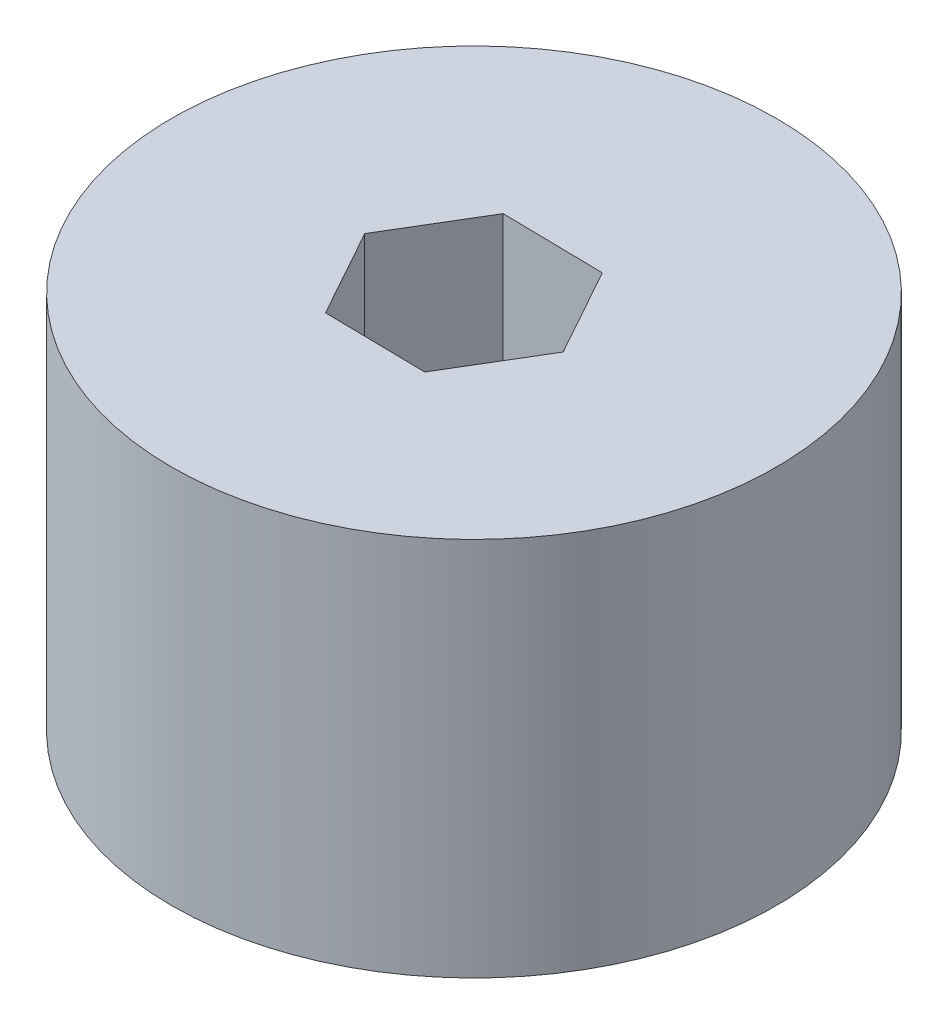
ISO-10303-21;
HEADER;
FILE_DESCRIPTION(('STEP AP214'),'2;1');
FILE_NAME('part.step','',(''),(''),'','','');
FILE_SCHEMA(('AUTOMOTIVE_DESIGN { 1 0 10303 214 1 1 1 1 }'));
ENDSEC;
DATA;
#1=APPLICATION_CONTEXT('core data for automotive mechanical design processes');
#2=APPLICATION_PROTOCOL_DEFINITION('international standard','automotive_design',2000,#1);
#3=PRODUCT_CONTEXT('',#1,'mechanical');
#4=PRODUCT('Part','Part','',(#3));
#5=PRODUCT_RELATED_PRODUCT_CATEGORY('part','',(#4));
#6=PRODUCT_DEFINITION_FORMATION('','',#4);
#7=PRODUCT_DEFINITION_CONTEXT('part definition',#1,'design');
#8=PRODUCT_DEFINITION('design','',#6,#7);
#9=PRODUCT_DEFINITION_SHAPE('','',#8);
#10=(LENGTH_UNIT() NAMED_UNIT(*) SI_UNIT(.MILLI.,.METRE.));
#11=(NAMED_UNIT(*) PLANE_ANGLE_UNIT() SI_UNIT($,.RADIAN.));
#12=(NAMED_UNIT(*) SI_UNIT($,.STERADIAN.) SOLID_ANGLE_UNIT());
#13=UNCERTAINTY_MEASURE_WITH_UNIT(LENGTH_MEASURE(1.E-05),#10,'distance_accuracy_value','');
#14=(GEOMETRIC_REPRESENTATION_CONTEXT(3) GLOBAL_UNCERTAINTY_ASSIGNED_CONTEXT((#13)) GLOBAL_UNIT_ASSIGNED_CONTEXT((#10,
#11,#12)) REPRESENTATION_CONTEXT('',''));
#15=CARTESIAN_POINT('',(0.,0.,0.));
#16=DIRECTION('',(0.,0.,1.));
#17=DIRECTION('',(1.,0.,0.));
#18=AXIS2_PLACEMENT_3D('',#15,#16,#17);
#19=CARTESIAN_POINT('',(0.,25.4,0.));
#20=DIRECTION('',(0.,1.,0.));
#21=DIRECTION('',(0.,0.,1.));
#22=AXIS2_PLACEMENT_3D('',#19,#20,#21);
#23=PLANE('',#22);
#24=CARTESIAN_POINT('',(0.,25.4,0.));
#25=DIRECTION('',(0.,1.,0.));
#26=DIRECTION('',(0.,0.,1.));
#27=AXIS2_PLACEMENT_3D('',#24,#25,#26);
#28=CIRCLE('',#27,20.209977283272);
#29=CARTESIAN_POINT('',(0.,25.4,20.209977283272));
#30=VERTEX_POINT('',#29);
#31=EDGE_CURVE('E11',#30,#30,#28,.T.);
#32=ORIENTED_EDGE('',*,*,#31,.T.);
#33=EDGE_LOOP('',(#32));
#34=FACE_BOUND('',#33,.T.);
#35=DIRECTION('',(0.514220942434934,0.,-0.857657753629808));
#36=VECTOR('',#35,1.);
#37=CARTESIAN_POINT('',(2.94549259193232,25.4,6.23963990172511));
#38=LINE('',#37,#36);
#39=CARTESIAN_POINT('',(2.94549259193232,25.4,6.23963990172511));
#40=VERTEX_POINT('',#39);
#41=CARTESIAN_POINT('',(6.41455048262457,25.4,0.453674857877559));
#42=VERTEX_POINT('',#41);
#43=EDGE_CURVE('E102',#40,#42,#38,.T.);
#44=ORIENTED_EDGE('',*,*,#43,.F.);
#45=DIRECTION('',(0.999863873613576,0.,0.0164995224917249));
#46=VECTOR('',#45,1.);
#47=CARTESIAN_POINT('',(-3.79982906679453,25.4,6.12833016311054));
#48=LINE('',#47,#46);
#49=CARTESIAN_POINT('',(-3.79982906679453,25.4,6.12833016311054));
#50=VERTEX_POINT('',#49);
#51=EDGE_CURVE('E93',#50,#40,#48,.T.);
#52=ORIENTED_EDGE('',*,*,#51,.F.);
#53=DIRECTION('',(0.485642931178642,0.,0.874157276121532));
#54=VECTOR('',#53,1.);
#55=CARTESIAN_POINT('',(-7.07609283482912,25.4,0.231055380648414));
#56=LINE('',#55,#54);
#57=CARTESIAN_POINT('',(-7.07609283482912,25.4,0.231055380648414));
#58=VERTEX_POINT('',#57);
#59=EDGE_CURVE('E127',#58,#50,#56,.T.);
#60=ORIENTED_EDGE('',*,*,#59,.F.);
#61=DIRECTION('',(-0.514220942434934,0.,0.857657753629808));
#62=VECTOR('',#61,1.);
#63=CARTESIAN_POINT('',(-3.60703494413687,25.4,-5.55490966319914));
#64=LINE('',#63,#62);
#65=CARTESIAN_POINT('',(-3.60703494413687,25.4,-5.55490966319914));
#66=VERTEX_POINT('',#65);
#67=EDGE_CURVE('E124',#66,#58,#64,.T.);
#68=ORIENTED_EDGE('',*,*,#67,.F.);
#69=DIRECTION('',(-0.999863873613576,0.,-0.016499522491725));
#70=VECTOR('',#69,1.);
#71=CARTESIAN_POINT('',(3.13828671458997,25.4,-5.44359992458456));
#72=LINE('',#71,#70);
#73=CARTESIAN_POINT('',(3.13828671458997,25.4,-5.44359992458456));
#74=VERTEX_POINT('',#73);
#75=EDGE_CURVE('E119',#74,#66,#72,.T.);
#76=ORIENTED_EDGE('',*,*,#75,.F.);
#77=DIRECTION('',(-0.485642931178642,0.,-0.874157276121532));
#78=VECTOR('',#77,1.);
#79=CARTESIAN_POINT('',(6.41455048262457,25.4,0.453674857877559));
#80=LINE('',#79,#78);
#81=EDGE_CURVE('E115',#42,#74,#80,.T.);
#82=ORIENTED_EDGE('',*,*,#81,.F.);
#83=EDGE_LOOP('',(#44,#52,#60,#68,#76,#82));
#84=FACE_BOUND('',#83,.T.);
#85=ADVANCED_FACE('F39',(#34,#84),#23,.T.);
#86=CARTESIAN_POINT('',(0.,0.,0.));
#87=DIRECTION('',(0.,1.,0.));
#88=DIRECTION('',(0.,0.,1.));
#89=AXIS2_PLACEMENT_3D('',#86,#87,#88);
#90=PLANE('',#89);
#91=CARTESIAN_POINT('',(0.,0.,0.));
#92=DIRECTION('',(0.,1.,0.));
#93=DIRECTION('',(0.,0.,1.));
#94=AXIS2_PLACEMENT_3D('',#91,#92,#93);
#95=CIRCLE('',#94,20.209977283272);
#96=CARTESIAN_POINT('',(0.,0.,20.209977283272));
#97=VERTEX_POINT('',#96);
#98=EDGE_CURVE('E43',#97,#97,#95,.T.);
#99=ORIENTED_EDGE('',*,*,#98,.F.);
#100=EDGE_LOOP('',(#99));
#101=FACE_BOUND('',#100,.T.);
#102=DIRECTION('',(0.999863873613576,0.,0.0164995224917249));
#103=VECTOR('',#102,1.);
#104=CARTESIAN_POINT('',(-3.79982906679453,0.,6.12833016311054));
#105=LINE('',#104,#103);
#106=CARTESIAN_POINT('',(-3.79982906679453,0.,6.12833016311053));
#107=VERTEX_POINT('',#106);
#108=CARTESIAN_POINT('',(2.94549259193232,0.,6.23963990172511));
#109=VERTEX_POINT('',#108);
#110=EDGE_CURVE('E63',#107,#109,#105,.T.);
#111=ORIENTED_EDGE('',*,*,#110,.T.);
#112=DIRECTION('',(0.514220942434934,0.,-0.857657753629808));
#113=VECTOR('',#112,1.);
#114=CARTESIAN_POINT('',(2.94549259193232,0.,6.23963990172511));
#115=LINE('',#114,#113);
#116=CARTESIAN_POINT('',(6.41455048262457,0.,0.453674857877559));
#117=VERTEX_POINT('',#116);
#118=EDGE_CURVE('E109',#109,#117,#115,.T.);
#119=ORIENTED_EDGE('',*,*,#118,.T.);
#120=DIRECTION('',(-0.485642931178642,0.,-0.874157276121532));
#121=VECTOR('',#120,1.);
#122=CARTESIAN_POINT('',(6.41455048262457,0.,0.453674857877559));
#123=LINE('',#122,#121);
#124=CARTESIAN_POINT('',(3.13828671458997,0.,-5.44359992458456));
#125=VERTEX_POINT('',#124);
#126=EDGE_CURVE('E134',#117,#125,#123,.T.);
#127=ORIENTED_EDGE('',*,*,#126,.T.);
#128=DIRECTION('',(-0.999863873613576,0.,-0.016499522491725));
#129=VECTOR('',#128,1.);
#130=CARTESIAN_POINT('',(3.13828671458997,0.,-5.44359992458456));
#131=LINE('',#130,#129);
#132=CARTESIAN_POINT('',(-3.60703494413687,0.,-5.55490966319914));
#133=VERTEX_POINT('',#132);
#134=EDGE_CURVE('E138',#125,#133,#131,.T.);
#135=ORIENTED_EDGE('',*,*,#134,.T.);
#136=DIRECTION('',(-0.514220942434934,0.,0.857657753629808));
#137=VECTOR('',#136,1.);
#138=CARTESIAN_POINT('',(-3.60703494413687,0.,-5.55490966319914));
#139=LINE('',#138,#137);
#140=CARTESIAN_POINT('',(-7.07609283482912,0.,0.231055380648414));
#141=VERTEX_POINT('',#140);
#142=EDGE_CURVE('E142',#133,#141,#139,.T.);
#143=ORIENTED_EDGE('',*,*,#142,.T.);
#144=DIRECTION('',(0.485642931178642,0.,0.874157276121532));
#145=VECTOR('',#144,1.);
#146=CARTESIAN_POINT('',(-7.07609283482912,0.,0.231055380648414));
#147=LINE('',#146,#145);
#148=EDGE_CURVE('E103',#141,#107,#147,.T.);
#149=ORIENTED_EDGE('',*,*,#148,.T.);
#150=EDGE_LOOP('',(#111,#119,#127,#135,#143,#149));
#151=FACE_BOUND('',#150,.T.);
#152=ADVANCED_FACE('F166',(#101,#151),#90,.F.);
#153=CARTESIAN_POINT('',(0.,25.4,0.));
#154=DIRECTION('',(0.,-1.,0.));
#155=DIRECTION('',(0.,0.,-1.));
#156=AXIS2_PLACEMENT_3D('',#153,#154,#155);
#157=CYLINDRICAL_SURFACE('',#156,20.209977283272);
#158=ORIENTED_EDGE('',*,*,#31,.F.);
#159=EDGE_LOOP('',(#158));
#160=FACE_BOUND('',#159,.T.);
#161=ORIENTED_EDGE('',*,*,#98,.T.);
#162=EDGE_LOOP('',(#161));
#163=FACE_BOUND('',#162,.T.);
#164=ADVANCED_FACE('F41',(#160,#163),#157,.T.);
#165=CARTESIAN_POINT('',(-3.79982906679453,25.4,6.12833016311054));
#166=DIRECTION('',(0.0164995224917249,0.,-0.999863873613576));
#167=DIRECTION('',(-0.999863873613576,0.,-0.0164995224917249));
#168=AXIS2_PLACEMENT_3D('',#165,#166,#167);
#169=PLANE('',#168);
#170=ORIENTED_EDGE('',*,*,#110,.F.);
#171=DIRECTION('',(0.,-1.,0.));
#172=VECTOR('',#171,1.);
#173=CARTESIAN_POINT('',(-3.79982906679453,25.4,6.12833016311054));
#174=LINE('',#173,#172);
#175=EDGE_CURVE('E97',#50,#107,#174,.T.);
#176=ORIENTED_EDGE('',*,*,#175,.F.);
#177=ORIENTED_EDGE('',*,*,#51,.T.);
#178=DIRECTION('',(0.,-1.,0.));
#179=VECTOR('',#178,1.);
#180=CARTESIAN_POINT('',(2.94549259193232,25.4,6.23963990172511));
#181=LINE('',#180,#179);
#182=EDGE_CURVE('E96',#40,#109,#181,.T.);
#183=ORIENTED_EDGE('',*,*,#182,.T.);
#184=EDGE_LOOP('',(#170,#176,#177,#183));
#185=FACE_BOUND('',#184,.T.);
#186=ADVANCED_FACE('F95',(#185),#169,.T.);
#187=CARTESIAN_POINT('',(2.94549259193232,25.4,6.23963990172511));
#188=DIRECTION('',(-0.857657753629808,0.,-0.514220942434934));
#189=DIRECTION('',(-0.514220942434934,0.,0.857657753629808));
#190=AXIS2_PLACEMENT_3D('',#187,#188,#189);
#191=PLANE('',#190);
#192=ORIENTED_EDGE('',*,*,#118,.F.);
#193=ORIENTED_EDGE('',*,*,#182,.F.);
#194=ORIENTED_EDGE('',*,*,#43,.T.);
#195=DIRECTION('',(0.,-1.,0.));
#196=VECTOR('',#195,1.);
#197=CARTESIAN_POINT('',(6.41455048262457,25.4,0.453674857877559));
#198=LINE('',#197,#196);
#199=EDGE_CURVE('E111',#42,#117,#198,.T.);
#200=ORIENTED_EDGE('',*,*,#199,.T.);
#201=EDGE_LOOP('',(#192,#193,#194,#200));
#202=FACE_BOUND('',#201,.T.);
#203=ADVANCED_FACE('F106',(#202),#191,.T.);
#204=CARTESIAN_POINT('',(6.41455048262457,25.4,0.453674857877559));
#205=DIRECTION('',(-0.874157276121532,0.,0.485642931178642));
#206=DIRECTION('',(0.485642931178642,0.,0.874157276121532));
#207=AXIS2_PLACEMENT_3D('',#204,#205,#206);
#208=PLANE('',#207);
#209=ORIENTED_EDGE('',*,*,#126,.F.);
#210=ORIENTED_EDGE('',*,*,#199,.F.);
#211=ORIENTED_EDGE('',*,*,#81,.T.);
#212=DIRECTION('',(0.,-1.,0.));
#213=VECTOR('',#212,1.);
#214=CARTESIAN_POINT('',(3.13828671458997,25.4,-5.44359992458456));
#215=LINE('',#214,#213);
#216=EDGE_CURVE('E156',#74,#125,#215,.T.);
#217=ORIENTED_EDGE('',*,*,#216,.T.);
#218=EDGE_LOOP('',(#209,#210,#211,#217));
#219=FACE_BOUND('',#218,.T.);
#220=ADVANCED_FACE('F162',(#219),#208,.T.);
#221=CARTESIAN_POINT('',(3.13828671458997,25.4,-5.44359992458456));
#222=DIRECTION('',(-0.016499522491725,0.,0.999863873613576));
#223=DIRECTION('',(0.999863873613576,0.,0.016499522491725));
#224=AXIS2_PLACEMENT_3D('',#221,#222,#223);
#225=PLANE('',#224);
#226=ORIENTED_EDGE('',*,*,#134,.F.);
#227=ORIENTED_EDGE('',*,*,#216,.F.);
#228=ORIENTED_EDGE('',*,*,#75,.T.);
#229=DIRECTION('',(0.,-1.,0.));
#230=VECTOR('',#229,1.);
#231=CARTESIAN_POINT('',(-3.60703494413687,25.4,-5.55490966319914));
#232=LINE('',#231,#230);
#233=EDGE_CURVE('E153',#66,#133,#232,.T.);
#234=ORIENTED_EDGE('',*,*,#233,.T.);
#235=EDGE_LOOP('',(#226,#227,#228,#234));
#236=FACE_BOUND('',#235,.T.);
#237=ADVANCED_FACE('F174',(#236),#225,.T.);
#238=CARTESIAN_POINT('',(-3.60703494413687,25.4,-5.55490966319914));
#239=DIRECTION('',(0.857657753629808,0.,0.514220942434934));
#240=DIRECTION('',(0.514220942434934,0.,-0.857657753629808));
#241=AXIS2_PLACEMENT_3D('',#238,#239,#240);
#242=PLANE('',#241);
#243=ORIENTED_EDGE('',*,*,#142,.F.);
#244=ORIENTED_EDGE('',*,*,#233,.F.);
#245=ORIENTED_EDGE('',*,*,#67,.T.);
#246=DIRECTION('',(0.,-1.,0.));
#247=VECTOR('',#246,1.);
#248=CARTESIAN_POINT('',(-7.07609283482912,25.4,0.231055380648414));
#249=LINE('',#248,#247);
#250=EDGE_CURVE('E55',#58,#141,#249,.T.);
#251=ORIENTED_EDGE('',*,*,#250,.T.);
#252=EDGE_LOOP('',(#243,#244,#245,#251));
#253=FACE_BOUND('',#252,.T.);
#254=ADVANCED_FACE('F172',(#253),#242,.T.);
#255=CARTESIAN_POINT('',(-7.07609283482912,25.4,0.231055380648414));
#256=DIRECTION('',(0.874157276121532,0.,-0.485642931178642));
#257=DIRECTION('',(-0.485642931178642,0.,-0.874157276121532));
#258=AXIS2_PLACEMENT_3D('',#255,#256,#257);
#259=PLANE('',#258);
#260=ORIENTED_EDGE('',*,*,#148,.F.);
#261=ORIENTED_EDGE('',*,*,#250,.F.);
#262=ORIENTED_EDGE('',*,*,#59,.T.);
#263=ORIENTED_EDGE('',*,*,#175,.T.);
#264=EDGE_LOOP('',(#260,#261,#262,#263));
#265=FACE_BOUND('',#264,.T.);
#266=ADVANCED_FACE('F168',(#265),#259,.T.);
#267=CLOSED_SHELL('',(#85,#152,#164,#186,#203,#220,#237,#254,#266));
#268=MANIFOLD_SOLID_BREP('B2',#267);
#269=ADVANCED_BREP_SHAPE_REPRESENTATION('',(#18,#268),#14);
#270=SHAPE_DEFINITION_REPRESENTATION(#9,#269);
ENDSEC;
END-ISO-10303-21;
